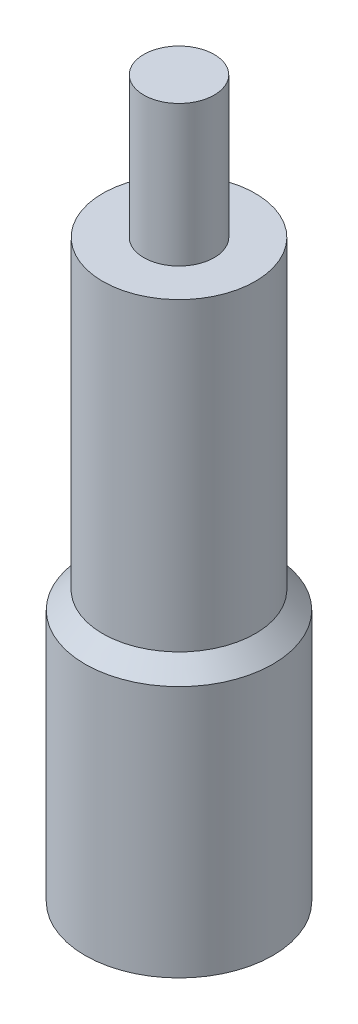
ISO-10303-21;
HEADER;
FILE_DESCRIPTION(('STEP AP214'),'2;1');
FILE_NAME('part.step','',(''),(''),'','','');
FILE_SCHEMA(('AUTOMOTIVE_DESIGN { 1 0 10303 214 1 1 1 1 }'));
ENDSEC;
DATA;
#1=APPLICATION_CONTEXT('core data for automotive mechanical design processes');
#2=APPLICATION_PROTOCOL_DEFINITION('international standard','automotive_design',2000,#1);
#3=PRODUCT_CONTEXT('',#1,'mechanical');
#4=PRODUCT('Part','Part','',(#3));
#5=PRODUCT_RELATED_PRODUCT_CATEGORY('part','',(#4));
#6=PRODUCT_DEFINITION_FORMATION('','',#4);
#7=PRODUCT_DEFINITION_CONTEXT('part definition',#1,'design');
#8=PRODUCT_DEFINITION('design','',#6,#7);
#9=PRODUCT_DEFINITION_SHAPE('','',#8);
#10=(LENGTH_UNIT() NAMED_UNIT(*) SI_UNIT(.MILLI.,.METRE.));
#11=(NAMED_UNIT(*) PLANE_ANGLE_UNIT() SI_UNIT($,.RADIAN.));
#12=(NAMED_UNIT(*) SI_UNIT($,.STERADIAN.) SOLID_ANGLE_UNIT());
#13=UNCERTAINTY_MEASURE_WITH_UNIT(LENGTH_MEASURE(1.E-05),#10,'distance_accuracy_value','');
#14=(GEOMETRIC_REPRESENTATION_CONTEXT(3) GLOBAL_UNCERTAINTY_ASSIGNED_CONTEXT((#13)) GLOBAL_UNIT_ASSIGNED_CONTEXT((#10,
#11,#12)) REPRESENTATION_CONTEXT('',''));
#15=CARTESIAN_POINT('',(0.,0.,0.));
#16=DIRECTION('',(0.,0.,1.));
#17=DIRECTION('',(1.,0.,0.));
#18=AXIS2_PLACEMENT_3D('',#15,#16,#17);
#19=CARTESIAN_POINT('',(0.,24.5,0.));
#20=DIRECTION('',(0.,-1.,0.));
#21=DIRECTION('',(0.,0.,-1.));
#22=AXIS2_PLACEMENT_3D('',#19,#20,#21);
#23=CYLINDRICAL_SURFACE('',#22,4.);
#24=CARTESIAN_POINT('',(0.,10.75,0.));
#25=DIRECTION('',(0.,1.,0.));
#26=DIRECTION('',(0.,0.,1.));
#27=AXIS2_PLACEMENT_3D('',#24,#25,#26);
#28=CIRCLE('',#27,4.);
#29=CARTESIAN_POINT('',(0.,10.75,4.));
#30=VERTEX_POINT('',#29);
#31=EDGE_CURVE('E12',#30,#30,#28,.F.);
#32=ORIENTED_EDGE('',*,*,#31,.T.);
#33=EDGE_LOOP('',(#32));
#34=FACE_BOUND('',#33,.T.);
#35=CARTESIAN_POINT('',(0.,0.,0.));
#36=DIRECTION('',(0.,1.,0.));
#37=DIRECTION('',(0.,0.,1.));
#38=AXIS2_PLACEMENT_3D('',#35,#36,#37);
#39=CIRCLE('',#38,4.);
#40=CARTESIAN_POINT('',(0.,0.,4.));
#41=VERTEX_POINT('',#40);
#42=EDGE_CURVE('E68',#41,#41,#39,.T.);
#43=ORIENTED_EDGE('',*,*,#42,.T.);
#44=EDGE_LOOP('',(#43));
#45=FACE_BOUND('',#44,.T.);
#46=ADVANCED_FACE('F43',(#34,#45),#23,.T.);
#47=CARTESIAN_POINT('',(0.,0.,0.));
#48=DIRECTION('',(0.,1.,0.));
#49=DIRECTION('',(0.,0.,1.));
#50=AXIS2_PLACEMENT_3D('',#47,#48,#49);
#51=PLANE('',#50);
#52=CARTESIAN_POINT('',(0.,0.,0.));
#53=DIRECTION('',(0.,-1.,0.));
#54=DIRECTION('',(0.,0.,-1.));
#55=AXIS2_PLACEMENT_3D('',#52,#53,#54);
#56=CIRCLE('',#55,2.1);
#57=CARTESIAN_POINT('',(0.,0.,-2.1));
#58=VERTEX_POINT('',#57);
#59=EDGE_CURVE('E65',#58,#58,#56,.T.);
#60=ORIENTED_EDGE('',*,*,#59,.F.);
#61=EDGE_LOOP('',(#60));
#62=FACE_BOUND('',#61,.T.);
#63=ORIENTED_EDGE('',*,*,#42,.F.);
#64=EDGE_LOOP('',(#63));
#65=FACE_BOUND('',#64,.T.);
#66=ADVANCED_FACE('F58',(#62,#65),#51,.F.);
#67=CARTESIAN_POINT('',(0.,10.,0.));
#68=DIRECTION('',(0.,-1.,0.));
#69=DIRECTION('',(0.,0.,-1.));
#70=AXIS2_PLACEMENT_3D('',#67,#68,#69);
#71=CONICAL_SURFACE('',#70,2.1,1.02974425867665);
#72=CARTESIAN_POINT('',(0.,11.2618072999579,0.));
#73=VERTEX_POINT('',#72);
#74=VERTEX_LOOP('',#73);
#75=FACE_BOUND('',#74,.T.);
#76=CARTESIAN_POINT('',(0.,10.,0.));
#77=DIRECTION('',(0.,-1.,0.));
#78=DIRECTION('',(0.,0.,-1.));
#79=AXIS2_PLACEMENT_3D('',#76,#77,#78);
#80=CIRCLE('',#79,2.1);
#81=CARTESIAN_POINT('',(0.,10.,-2.1));
#82=VERTEX_POINT('',#81);
#83=EDGE_CURVE('E62',#82,#82,#80,.T.);
#84=ORIENTED_EDGE('',*,*,#83,.T.);
#85=EDGE_LOOP('',(#84));
#86=FACE_BOUND('',#85,.T.);
#87=ADVANCED_FACE('F54',(#75,#86),#71,.F.);
#88=CARTESIAN_POINT('',(0.,0.,0.));
#89=DIRECTION('',(0.,-1.,0.));
#90=DIRECTION('',(0.,0.,-1.));
#91=AXIS2_PLACEMENT_3D('',#88,#89,#90);
#92=CYLINDRICAL_SURFACE('',#91,2.1);
#93=ORIENTED_EDGE('',*,*,#83,.F.);
#94=EDGE_LOOP('',(#93));
#95=FACE_BOUND('',#94,.T.);
#96=ORIENTED_EDGE('',*,*,#59,.T.);
#97=EDGE_LOOP('',(#96));
#98=FACE_BOUND('',#97,.T.);
#99=ADVANCED_FACE('F57',(#95,#98),#92,.F.);
#100=CARTESIAN_POINT('',(0.,11.5,0.));
#101=DIRECTION('',(0.,1.,0.));
#102=DIRECTION('',(0.,0.,1.));
#103=AXIS2_PLACEMENT_3D('',#100,#101,#102);
#104=CYLINDRICAL_SURFACE('',#103,3.25);
#105=CARTESIAN_POINT('',(0.,11.5,0.));
#106=DIRECTION('',(0.,1.,0.));
#107=DIRECTION('',(0.,0.,1.));
#108=AXIS2_PLACEMENT_3D('',#105,#106,#107);
#109=CIRCLE('',#108,3.25);
#110=CARTESIAN_POINT('',(0.,11.5,3.25));
#111=VERTEX_POINT('',#110);
#112=EDGE_CURVE('E71',#111,#111,#109,.T.);
#113=CARTESIAN_POINT('',(0.,24.5,0.));
#114=DIRECTION('',(0.,1.,0.));
#115=DIRECTION('',(0.,0.,1.));
#116=AXIS2_PLACEMENT_3D('',#113,#114,#115);
#117=CIRCLE('',#116,3.25);
#118=CARTESIAN_POINT('',(0.,24.5,3.25));
#119=VERTEX_POINT('',#118);
#120=EDGE_CURVE('E113',#119,#119,#117,.T.);
#121=CARTESIAN_POINT('',(0.,11.5,3.25));
#122=CARTESIAN_POINT('',(0.,11.6354166666667,3.25));
#123=CARTESIAN_POINT('',(0.,11.7708333333333,3.25));
#124=CARTESIAN_POINT('',(0.,12.0416666666667,3.25));
#125=CARTESIAN_POINT('',(0.,12.1770833333333,3.25));
#126=CARTESIAN_POINT('',(0.,12.4479166666667,3.25));
#127=CARTESIAN_POINT('',(0.,12.5833333333333,3.25));
#128=CARTESIAN_POINT('',(0.,12.8541666666667,3.25));
#129=CARTESIAN_POINT('',(0.,12.9895833333333,3.25));
#130=CARTESIAN_POINT('',(0.,13.2604166666667,3.25));
#131=CARTESIAN_POINT('',(0.,13.3958333333333,3.25));
#132=CARTESIAN_POINT('',(0.,13.6666666666667,3.25));
#133=CARTESIAN_POINT('',(0.,13.8020833333333,3.25));
#134=CARTESIAN_POINT('',(0.,14.0729166666667,3.25));
#135=CARTESIAN_POINT('',(0.,14.2083333333333,3.25));
#136=CARTESIAN_POINT('',(0.,14.4791666666667,3.25));
#137=CARTESIAN_POINT('',(0.,14.6145833333333,3.25));
#138=CARTESIAN_POINT('',(0.,14.8854166666667,3.25));
#139=CARTESIAN_POINT('',(0.,15.0208333333333,3.25));
#140=CARTESIAN_POINT('',(0.,15.2916666666667,3.25));
#141=CARTESIAN_POINT('',(0.,15.4270833333333,3.25));
#142=CARTESIAN_POINT('',(0.,15.6979166666667,3.25));
#143=CARTESIAN_POINT('',(0.,15.8333333333333,3.25));
#144=CARTESIAN_POINT('',(0.,16.1041666666667,3.25));
#145=CARTESIAN_POINT('',(0.,16.2395833333333,3.25));
#146=CARTESIAN_POINT('',(0.,16.5104166666667,3.25));
#147=CARTESIAN_POINT('',(0.,16.6458333333333,3.25));
#148=CARTESIAN_POINT('',(0.,16.9166666666667,3.25));
#149=CARTESIAN_POINT('',(0.,17.0520833333333,3.25));
#150=CARTESIAN_POINT('',(0.,17.3229166666667,3.25));
#151=CARTESIAN_POINT('',(0.,17.4583333333333,3.25));
#152=CARTESIAN_POINT('',(0.,17.7291666666667,3.25));
#153=CARTESIAN_POINT('',(0.,17.8645833333333,3.25));
#154=CARTESIAN_POINT('',(0.,18.1354166666667,3.25));
#155=CARTESIAN_POINT('',(0.,18.2708333333333,3.25));
#156=CARTESIAN_POINT('',(0.,18.5416666666667,3.25));
#157=CARTESIAN_POINT('',(0.,18.6770833333333,3.25));
#158=CARTESIAN_POINT('',(0.,18.9479166666667,3.25));
#159=CARTESIAN_POINT('',(0.,19.0833333333333,3.25));
#160=CARTESIAN_POINT('',(0.,19.3541666666667,3.25));
#161=CARTESIAN_POINT('',(0.,19.4895833333333,3.25));
#162=CARTESIAN_POINT('',(0.,19.7604166666667,3.25));
#163=CARTESIAN_POINT('',(0.,19.8958333333333,3.25));
#164=CARTESIAN_POINT('',(0.,20.1666666666667,3.25));
#165=CARTESIAN_POINT('',(0.,20.3020833333333,3.25));
#166=CARTESIAN_POINT('',(0.,20.5729166666667,3.25));
#167=CARTESIAN_POINT('',(0.,20.7083333333333,3.25));
#168=CARTESIAN_POINT('',(0.,20.9791666666667,3.25));
#169=CARTESIAN_POINT('',(0.,21.1145833333333,3.25));
#170=CARTESIAN_POINT('',(0.,21.3854166666667,3.25));
#171=CARTESIAN_POINT('',(0.,21.5208333333333,3.25));
#172=CARTESIAN_POINT('',(0.,21.7916666666667,3.25));
#173=CARTESIAN_POINT('',(0.,21.9270833333333,3.25));
#174=CARTESIAN_POINT('',(0.,22.1979166666667,3.25));
#175=CARTESIAN_POINT('',(0.,22.3333333333333,3.25));
#176=CARTESIAN_POINT('',(0.,22.6041666666667,3.25));
#177=CARTESIAN_POINT('',(0.,22.7395833333333,3.25));
#178=CARTESIAN_POINT('',(0.,23.0104166666667,3.25));
#179=CARTESIAN_POINT('',(0.,23.1458333333333,3.25));
#180=CARTESIAN_POINT('',(0.,23.4166666666667,3.25));
#181=CARTESIAN_POINT('',(0.,23.5520833333333,3.25));
#182=CARTESIAN_POINT('',(0.,23.8229166666667,3.25));
#183=CARTESIAN_POINT('',(0.,23.9583333333333,3.25));
#184=CARTESIAN_POINT('',(0.,24.2291666666667,3.25));
#185=CARTESIAN_POINT('',(0.,24.3645833333333,3.25));
#186=CARTESIAN_POINT('',(0.,24.5,3.25));
#187=B_SPLINE_CURVE_WITH_KNOTS('',3,(#121,#122,#123,#124,#125,#126,#127,#128,#129,#130,#131,
#132,#133,#134,#135,#136,#137,#138,#139,#140,#141,#142,#143,#144,#145,#146,#147,#148,#149,#150,
#151,#152,#153,#154,#155,#156,#157,#158,#159,#160,#161,#162,#163,#164,#165,#166,#167,#168,#169,
#170,#171,#172,#173,#174,#175,#176,#177,#178,#179,#180,#181,#182,#183,#184,#185,#186),
.UNSPECIFIED.,.F.,.F.,(4,2,2,2,2,2,2,2,2,2,2,2,2,2,2,2,2,2,2,2,2,2,2,2,2,2,2,2,2,2,2,2,4),(0.,
0.406249999999999,0.812499999999999,1.21875,1.625,2.03125,2.4375,2.84375,3.25,3.65625,4.0625,
4.46875,4.875,5.28125,5.6875,6.09375,6.5,6.90625,7.3125,7.71875,8.12499999999999,8.53125,8.9375,
9.34375,9.75,10.15625,10.5625,10.96875,11.375,11.78125,12.1875,12.59375,13.),.UNSPECIFIED.);
#188=EDGE_CURVE('BSEAM99',#111,#119,#187,.T.);
#189=ORIENTED_EDGE('',*,*,#112,.T.);
#190=ORIENTED_EDGE('',*,*,#120,.F.);
#191=ORIENTED_EDGE('',*,*,#188,.T.);
#192=ORIENTED_EDGE('',*,*,#188,.F.);
#193=EDGE_LOOP('',(#189,#191,#190,#192));
#194=FACE_BOUND('',#193,.T.);
#195=ADVANCED_FACE('F99',(#194),#104,.T.);
#196=CARTESIAN_POINT('',(0.,30.5,0.));
#197=DIRECTION('',(0.,1.,0.));
#198=DIRECTION('',(0.,0.,1.));
#199=AXIS2_PLACEMENT_3D('',#196,#197,#198);
#200=PLANE('',#199);
#201=CARTESIAN_POINT('',(0.,30.5,0.));
#202=DIRECTION('',(0.,1.,0.));
#203=DIRECTION('',(0.,0.,1.));
#204=AXIS2_PLACEMENT_3D('',#201,#202,#203);
#205=CIRCLE('',#204,1.5);
#206=CARTESIAN_POINT('',(0.,30.5,1.5));
#207=VERTEX_POINT('',#206);
#208=EDGE_CURVE('E64',#207,#207,#205,.T.);
#209=ORIENTED_EDGE('',*,*,#208,.T.);
#210=EDGE_LOOP('',(#209));
#211=FACE_BOUND('',#210,.T.);
#212=ADVANCED_FACE('F96',(#211),#200,.T.);
#213=CARTESIAN_POINT('',(0.,30.5,0.));
#214=DIRECTION('',(0.,-1.,0.));
#215=DIRECTION('',(0.,0.,-1.));
#216=AXIS2_PLACEMENT_3D('',#213,#214,#215);
#217=CYLINDRICAL_SURFACE('',#216,1.5);
#218=ORIENTED_EDGE('',*,*,#208,.F.);
#219=EDGE_LOOP('',(#218));
#220=FACE_BOUND('',#219,.T.);
#221=CARTESIAN_POINT('',(0.,24.5,0.));
#222=DIRECTION('',(0.,1.,0.));
#223=DIRECTION('',(0.,0.,1.));
#224=AXIS2_PLACEMENT_3D('',#221,#222,#223);
#225=CIRCLE('',#224,1.5);
#226=CARTESIAN_POINT('',(0.,24.5,1.5));
#227=VERTEX_POINT('',#226);
#228=EDGE_CURVE('E51',#227,#227,#225,.T.);
#229=ORIENTED_EDGE('',*,*,#228,.T.);
#230=EDGE_LOOP('',(#229));
#231=FACE_BOUND('',#230,.T.);
#232=ADVANCED_FACE('F92',(#220,#231),#217,.T.);
#233=CARTESIAN_POINT('',(0.,24.5,0.));
#234=DIRECTION('',(0.,1.,0.));
#235=DIRECTION('',(0.,0.,1.));
#236=AXIS2_PLACEMENT_3D('',#233,#234,#235);
#237=PLANE('',#236);
#238=ORIENTED_EDGE('',*,*,#228,.F.);
#239=EDGE_LOOP('',(#238));
#240=FACE_BOUND('',#239,.T.);
#241=ORIENTED_EDGE('',*,*,#120,.T.);
#242=EDGE_LOOP('',(#241));
#243=FACE_BOUND('',#242,.T.);
#244=ADVANCED_FACE('F89',(#240,#243),#237,.T.);
#245=CARTESIAN_POINT('',(0.,11.5,0.));
#246=DIRECTION('',(0.,-1.,0.));
#247=DIRECTION('',(0.,0.,-1.));
#248=AXIS2_PLACEMENT_3D('',#245,#246,#247);
#249=CONICAL_SURFACE('',#248,3.25,0.785398163397446);
#250=ORIENTED_EDGE('',*,*,#31,.F.);
#251=EDGE_LOOP('',(#250));
#252=FACE_BOUND('',#251,.T.);
#253=ORIENTED_EDGE('',*,*,#112,.F.);
#254=EDGE_LOOP('',(#253));
#255=FACE_BOUND('',#254,.T.);
#256=ADVANCED_FACE('F46',(#252,#255),#249,.T.);
#257=CLOSED_SHELL('',(#46,#66,#87,#99,#195,#212,#232,#244,#256));
#258=MANIFOLD_SOLID_BREP('B2',#257);
#259=ADVANCED_BREP_SHAPE_REPRESENTATION('',(#18,#258),#14);
#260=SHAPE_DEFINITION_REPRESENTATION(#9,#259);
ENDSEC;
END-ISO-10303-21;
